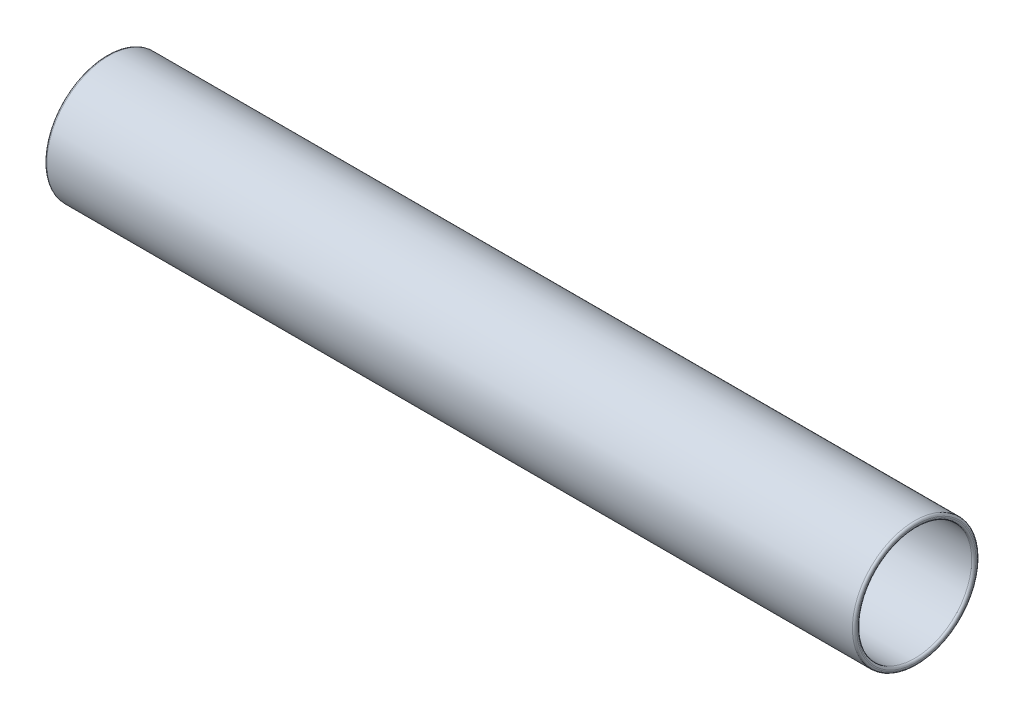
ISO-10303-21;
HEADER;
FILE_DESCRIPTION(('STEP AP214'),'2;1');
FILE_NAME('part.step','',(''),(''),'','','');
FILE_SCHEMA(('AUTOMOTIVE_DESIGN { 1 0 10303 214 1 1 1 1 }'));
ENDSEC;
DATA;
#1=APPLICATION_CONTEXT('core data for automotive mechanical design processes');
#2=APPLICATION_PROTOCOL_DEFINITION('international standard','automotive_design',2000,#1);
#3=PRODUCT_CONTEXT('',#1,'mechanical');
#4=PRODUCT('Part','Part','',(#3));
#5=PRODUCT_RELATED_PRODUCT_CATEGORY('part','',(#4));
#6=PRODUCT_DEFINITION_FORMATION('','',#4);
#7=PRODUCT_DEFINITION_CONTEXT('part definition',#1,'design');
#8=PRODUCT_DEFINITION('design','',#6,#7);
#9=PRODUCT_DEFINITION_SHAPE('','',#8);
#10=(LENGTH_UNIT() NAMED_UNIT(*) SI_UNIT(.MILLI.,.METRE.));
#11=(NAMED_UNIT(*) PLANE_ANGLE_UNIT() SI_UNIT($,.RADIAN.));
#12=(NAMED_UNIT(*) SI_UNIT($,.STERADIAN.) SOLID_ANGLE_UNIT());
#13=UNCERTAINTY_MEASURE_WITH_UNIT(LENGTH_MEASURE(1.E-05),#10,'distance_accuracy_value','');
#14=(GEOMETRIC_REPRESENTATION_CONTEXT(3) GLOBAL_UNCERTAINTY_ASSIGNED_CONTEXT((#13)) GLOBAL_UNIT_ASSIGNED_CONTEXT((#10,
#11,#12)) REPRESENTATION_CONTEXT('',''));
#15=CARTESIAN_POINT('',(0.,0.,0.));
#16=DIRECTION('',(0.,0.,1.));
#17=DIRECTION('',(1.,0.,0.));
#18=AXIS2_PLACEMENT_3D('',#15,#16,#17);
#19=CARTESIAN_POINT('',(750.,0.,0.));
#20=DIRECTION('',(1.,0.,0.));
#21=DIRECTION('',(0.,0.,-1.));
#22=AXIS2_PLACEMENT_3D('',#19,#20,#21);
#23=PLANE('',#22);
#24=CARTESIAN_POINT('',(750.,0.,0.));
#25=DIRECTION('',(1.,0.,0.));
#26=DIRECTION('',(0.,0.,-1.));
#27=AXIS2_PLACEMENT_3D('',#24,#25,#26);
#28=CIRCLE('',#27,54.75);
#29=CARTESIAN_POINT('',(750.,0.,-54.75));
#30=VERTEX_POINT('',#29);
#31=EDGE_CURVE('E77',#30,#30,#28,.F.);
#32=ORIENTED_EDGE('',*,*,#31,.T.);
#33=EDGE_LOOP('',(#32));
#34=FACE_BOUND('',#33,.T.);
#35=CARTESIAN_POINT('',(750.,0.,0.));
#36=DIRECTION('',(1.,0.,0.));
#37=DIRECTION('',(0.,0.,-1.));
#38=AXIS2_PLACEMENT_3D('',#35,#36,#37);
#39=CIRCLE('',#38,55.75);
#40=CARTESIAN_POINT('',(750.,0.,-55.75));
#41=VERTEX_POINT('',#40);
#42=EDGE_CURVE('E81',#41,#41,#39,.T.);
#43=ORIENTED_EDGE('',*,*,#42,.T.);
#44=EDGE_LOOP('',(#43));
#45=FACE_BOUND('',#44,.T.);
#46=ADVANCED_FACE('F49',(#34,#45),#23,.T.);
#47=CARTESIAN_POINT('',(0.,0.,0.));
#48=DIRECTION('',(1.,0.,0.));
#49=DIRECTION('',(0.,0.,-1.));
#50=AXIS2_PLACEMENT_3D('',#47,#48,#49);
#51=PLANE('',#50);
#52=CARTESIAN_POINT('',(0.,0.,0.));
#53=DIRECTION('',(1.,0.,0.));
#54=DIRECTION('',(0.,0.,-1.));
#55=AXIS2_PLACEMENT_3D('',#52,#53,#54);
#56=CIRCLE('',#55,54.75);
#57=CARTESIAN_POINT('',(0.,0.,-54.75));
#58=VERTEX_POINT('',#57);
#59=EDGE_CURVE('E62',#58,#58,#56,.T.);
#60=ORIENTED_EDGE('',*,*,#59,.T.);
#61=EDGE_LOOP('',(#60));
#62=FACE_BOUND('',#61,.T.);
#63=CARTESIAN_POINT('',(0.,0.,0.));
#64=DIRECTION('',(1.,0.,0.));
#65=DIRECTION('',(0.,0.,-1.));
#66=AXIS2_PLACEMENT_3D('',#63,#64,#65);
#67=CIRCLE('',#66,55.75);
#68=CARTESIAN_POINT('',(0.,0.,-55.75));
#69=VERTEX_POINT('',#68);
#70=EDGE_CURVE('E67',#69,#69,#67,.F.);
#71=ORIENTED_EDGE('',*,*,#70,.T.);
#72=EDGE_LOOP('',(#71));
#73=FACE_BOUND('',#72,.T.);
#74=ADVANCED_FACE('F109',(#62,#73),#51,.F.);
#75=CARTESIAN_POINT('',(750.,0.,0.));
#76=DIRECTION('',(-1.,0.,0.));
#77=DIRECTION('',(0.,0.,1.));
#78=AXIS2_PLACEMENT_3D('',#75,#76,#77);
#79=CYLINDRICAL_SURFACE('',#78,57.75);
#80=CARTESIAN_POINT('',(2.,0.,0.));
#81=DIRECTION('',(1.,0.,0.));
#82=DIRECTION('',(0.,0.,-1.));
#83=AXIS2_PLACEMENT_3D('',#80,#81,#82);
#84=CIRCLE('',#83,57.75);
#85=CARTESIAN_POINT('',(2.,0.,-57.75));
#86=VERTEX_POINT('',#85);
#87=EDGE_CURVE('E12',#86,#86,#84,.T.);
#88=ORIENTED_EDGE('',*,*,#87,.T.);
#89=EDGE_LOOP('',(#88));
#90=FACE_BOUND('',#89,.T.);
#91=CARTESIAN_POINT('',(748.,0.,0.));
#92=DIRECTION('',(1.,0.,0.));
#93=DIRECTION('',(0.,0.,-1.));
#94=AXIS2_PLACEMENT_3D('',#91,#92,#93);
#95=CIRCLE('',#94,57.75);
#96=CARTESIAN_POINT('',(748.,0.,-57.75));
#97=VERTEX_POINT('',#96);
#98=EDGE_CURVE('E73',#97,#97,#95,.F.);
#99=ORIENTED_EDGE('',*,*,#98,.T.);
#100=EDGE_LOOP('',(#99));
#101=FACE_BOUND('',#100,.T.);
#102=ADVANCED_FACE('F104',(#90,#101),#79,.T.);
#103=CARTESIAN_POINT('',(750.,0.,0.));
#104=DIRECTION('',(-1.,0.,0.));
#105=DIRECTION('',(0.,0.,1.));
#106=AXIS2_PLACEMENT_3D('',#103,#104,#105);
#107=CYLINDRICAL_SURFACE('',#106,52.75);
#108=CARTESIAN_POINT('',(2.,0.,0.));
#109=DIRECTION('',(1.,0.,0.));
#110=DIRECTION('',(0.,0.,-1.));
#111=AXIS2_PLACEMENT_3D('',#108,#109,#110);
#112=CIRCLE('',#111,52.75);
#113=CARTESIAN_POINT('',(2.,0.,-52.75));
#114=VERTEX_POINT('',#113);
#115=EDGE_CURVE('E57',#114,#114,#112,.F.);
#116=ORIENTED_EDGE('',*,*,#115,.T.);
#117=EDGE_LOOP('',(#116));
#118=FACE_BOUND('',#117,.T.);
#119=CARTESIAN_POINT('',(748.,0.,0.));
#120=DIRECTION('',(1.,0.,0.));
#121=DIRECTION('',(0.,0.,-1.));
#122=AXIS2_PLACEMENT_3D('',#119,#120,#121);
#123=CIRCLE('',#122,52.75);
#124=CARTESIAN_POINT('',(748.,0.,-52.75));
#125=VERTEX_POINT('',#124);
#126=EDGE_CURVE('E85',#125,#125,#123,.T.);
#127=ORIENTED_EDGE('',*,*,#126,.T.);
#128=EDGE_LOOP('',(#127));
#129=FACE_BOUND('',#128,.T.);
#130=ADVANCED_FACE('F90',(#118,#129),#107,.F.);
#131=CARTESIAN_POINT('',(748.,0.,0.));
#132=DIRECTION('',(1.,0.,0.));
#133=DIRECTION('',(0.,0.,-1.));
#134=AXIS2_PLACEMENT_3D('',#131,#132,#133);
#135=TOROIDAL_SURFACE('',#134,54.75,2.);
#136=ORIENTED_EDGE('',*,*,#31,.F.);
#137=EDGE_LOOP('',(#136));
#138=FACE_BOUND('',#137,.T.);
#139=ORIENTED_EDGE('',*,*,#126,.F.);
#140=EDGE_LOOP('',(#139));
#141=FACE_BOUND('',#140,.T.);
#142=ADVANCED_FACE('F92',(#138,#141),#135,.T.);
#143=CARTESIAN_POINT('',(748.,0.,0.));
#144=DIRECTION('',(1.,0.,0.));
#145=DIRECTION('',(0.,0.,-1.));
#146=AXIS2_PLACEMENT_3D('',#143,#144,#145);
#147=TOROIDAL_SURFACE('',#146,55.75,2.);
#148=ORIENTED_EDGE('',*,*,#98,.F.);
#149=EDGE_LOOP('',(#148));
#150=FACE_BOUND('',#149,.T.);
#151=ORIENTED_EDGE('',*,*,#42,.F.);
#152=EDGE_LOOP('',(#151));
#153=FACE_BOUND('',#152,.T.);
#154=ADVANCED_FACE('F94',(#150,#153),#147,.T.);
#155=CARTESIAN_POINT('',(2.,0.,0.));
#156=DIRECTION('',(1.,0.,0.));
#157=DIRECTION('',(0.,0.,-1.));
#158=AXIS2_PLACEMENT_3D('',#155,#156,#157);
#159=TOROIDAL_SURFACE('',#158,54.75,2.);
#160=ORIENTED_EDGE('',*,*,#115,.F.);
#161=EDGE_LOOP('',(#160));
#162=FACE_BOUND('',#161,.T.);
#163=ORIENTED_EDGE('',*,*,#59,.F.);
#164=EDGE_LOOP('',(#163));
#165=FACE_BOUND('',#164,.T.);
#166=ADVANCED_FACE('F101',(#162,#165),#159,.T.);
#167=CARTESIAN_POINT('',(2.,0.,0.));
#168=DIRECTION('',(1.,0.,0.));
#169=DIRECTION('',(0.,0.,-1.));
#170=AXIS2_PLACEMENT_3D('',#167,#168,#169);
#171=TOROIDAL_SURFACE('',#170,55.75,2.);
#172=ORIENTED_EDGE('',*,*,#70,.F.);
#173=EDGE_LOOP('',(#172));
#174=FACE_BOUND('',#173,.T.);
#175=ORIENTED_EDGE('',*,*,#87,.F.);
#176=EDGE_LOOP('',(#175));
#177=FACE_BOUND('',#176,.T.);
#178=ADVANCED_FACE('F51',(#174,#177),#171,.T.);
#179=CLOSED_SHELL('',(#46,#74,#102,#130,#142,#154,#166,#178));
#180=MANIFOLD_SOLID_BREP('B2',#179);
#181=ADVANCED_BREP_SHAPE_REPRESENTATION('',(#18,#180),#14);
#182=SHAPE_DEFINITION_REPRESENTATION(#9,#181);
ENDSEC;
END-ISO-10303-21;
